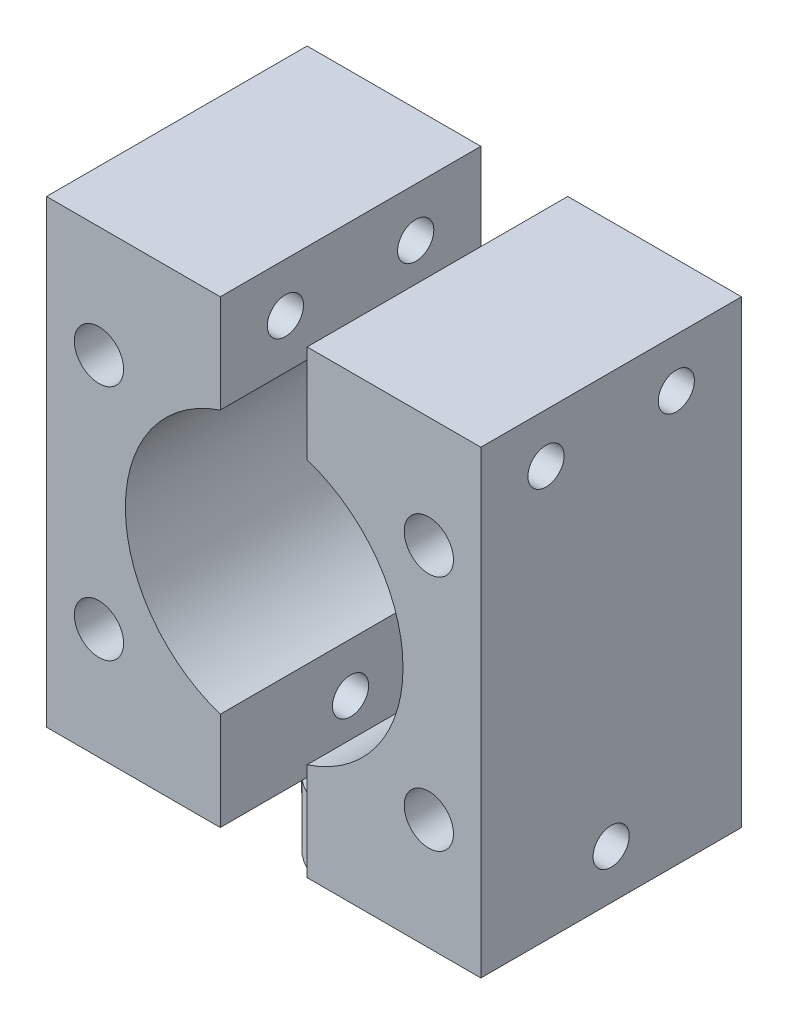
ISO-10303-21;
HEADER;
FILE_DESCRIPTION(('STEP AP214'),'2;1');
FILE_NAME('part.step','',(''),(''),'','','');
FILE_SCHEMA(('AUTOMOTIVE_DESIGN { 1 0 10303 214 1 1 1 1 }'));
ENDSEC;
DATA;
#1=APPLICATION_CONTEXT('core data for automotive mechanical design processes');
#2=APPLICATION_PROTOCOL_DEFINITION('international standard','automotive_design',2000,#1);
#3=PRODUCT_CONTEXT('',#1,'mechanical');
#4=PRODUCT('Part','Part','',(#3));
#5=PRODUCT_RELATED_PRODUCT_CATEGORY('part','',(#4));
#6=PRODUCT_DEFINITION_FORMATION('','',#4);
#7=PRODUCT_DEFINITION_CONTEXT('part definition',#1,'design');
#8=PRODUCT_DEFINITION('design','',#6,#7);
#9=PRODUCT_DEFINITION_SHAPE('','',#8);
#10=(LENGTH_UNIT() NAMED_UNIT(*) SI_UNIT(.MILLI.,.METRE.));
#11=(NAMED_UNIT(*) PLANE_ANGLE_UNIT() SI_UNIT($,.RADIAN.));
#12=(NAMED_UNIT(*) SI_UNIT($,.STERADIAN.) SOLID_ANGLE_UNIT());
#13=UNCERTAINTY_MEASURE_WITH_UNIT(LENGTH_MEASURE(1.E-05),#10,'distance_accuracy_value','');
#14=(GEOMETRIC_REPRESENTATION_CONTEXT(3) GLOBAL_UNCERTAINTY_ASSIGNED_CONTEXT((#13)) GLOBAL_UNIT_ASSIGNED_CONTEXT((#10,
#11,#12)) REPRESENTATION_CONTEXT('',''));
#15=CARTESIAN_POINT('',(0.,0.,0.));
#16=DIRECTION('',(0.,0.,1.));
#17=DIRECTION('',(1.,0.,0.));
#18=AXIS2_PLACEMENT_3D('',#15,#16,#17);
#19=CARTESIAN_POINT('',(-15.,4.5,-8.65612108217187));
#20=DIRECTION('',(0.,-1.,0.));
#21=DIRECTION('',(0.,0.,-1.));
#22=AXIS2_PLACEMENT_3D('',#19,#20,#21);
#23=PLANE('',#22);
#24=CARTESIAN_POINT('',(-6.4951905283833,4.5,3.74999999999998));
#25=DIRECTION('',(0.,-1.,0.));
#26=DIRECTION('',(0.,0.,-1.));
#27=AXIS2_PLACEMENT_3D('',#24,#25,#26);
#28=CIRCLE('',#27,0.79999999999999);
#29=CARTESIAN_POINT('',(-6.4951905283833,4.5,2.94999999999999));
#30=VERTEX_POINT('',#29);
#31=EDGE_CURVE('E128',#30,#30,#28,.T.);
#32=ORIENTED_EDGE('',*,*,#31,.F.);
#33=EDGE_LOOP('',(#32));
#34=FACE_BOUND('',#33,.T.);
#35=DIRECTION('',(0.,0.,-1.));
#36=VECTOR('',#35,1.);
#37=CARTESIAN_POINT('',(-3.,4.5,-8.65612108217187));
#38=LINE('',#37,#36);
#39=CARTESIAN_POINT('',(-3.,4.5,-3.68272996566406));
#40=VERTEX_POINT('',#39);
#41=CARTESIAN_POINT('',(-3.,4.5,-8.65612108217187));
#42=VERTEX_POINT('',#41);
#43=EDGE_CURVE('E194',#40,#42,#38,.T.);
#44=ORIENTED_EDGE('',*,*,#43,.F.);
#45=CARTESIAN_POINT('',(0.,4.5,0.));
#46=DIRECTION('',(0.,1.,0.));
#47=DIRECTION('',(0.,0.,1.));
#48=AXIS2_PLACEMENT_3D('',#45,#46,#47);
#49=CIRCLE('',#48,4.75);
#50=CARTESIAN_POINT('',(-3.,4.5,3.68272996566406));
#51=VERTEX_POINT('',#50);
#52=EDGE_CURVE('E167',#40,#51,#49,.T.);
#53=ORIENTED_EDGE('',*,*,#52,.T.);
#54=CARTESIAN_POINT('',(-3.,4.5,9.34387891782813));
#55=VERTEX_POINT('',#54);
#56=EDGE_CURVE('E180',#55,#51,#38,.T.);
#57=ORIENTED_EDGE('',*,*,#56,.F.);
#58=DIRECTION('',(1.,0.,0.));
#59=VECTOR('',#58,1.);
#60=CARTESIAN_POINT('',(-3.,4.5,9.34387891782813));
#61=LINE('',#60,#59);
#62=CARTESIAN_POINT('',(-15.,4.5,9.34387891782813));
#63=VERTEX_POINT('',#62);
#64=EDGE_CURVE('E191',#63,#55,#61,.T.);
#65=ORIENTED_EDGE('',*,*,#64,.F.);
#66=DIRECTION('',(0.,0.,1.));
#67=VECTOR('',#66,1.);
#68=CARTESIAN_POINT('',(-15.,4.5,9.34387891782813));
#69=LINE('',#68,#67);
#70=CARTESIAN_POINT('',(-15.,4.5,-8.65612108217187));
#71=VERTEX_POINT('',#70);
#72=EDGE_CURVE('E189',#71,#63,#69,.T.);
#73=ORIENTED_EDGE('',*,*,#72,.F.);
#74=DIRECTION('',(-1.,0.,0.));
#75=VECTOR('',#74,1.);
#76=CARTESIAN_POINT('',(-3.,4.5,-8.65612108217187));
#77=LINE('',#76,#75);
#78=EDGE_CURVE('E175',#42,#71,#77,.T.);
#79=ORIENTED_EDGE('',*,*,#78,.F.);
#80=EDGE_LOOP('',(#44,#53,#57,#65,#73,#79));
#81=FACE_BOUND('',#80,.T.);
#82=ADVANCED_FACE('F43',(#34,#81),#23,.T.);
#83=CARTESIAN_POINT('',(-3.,36.25,-8.65612108217187));
#84=DIRECTION('',(0.,0.,1.));
#85=DIRECTION('',(1.,0.,0.));
#86=AXIS2_PLACEMENT_3D('',#83,#84,#85);
#87=PLANE('',#86);
#88=CARTESIAN_POINT('',(-11.3772186390947,28.569859147129,-8.65612108217187));
#89=DIRECTION('',(0.,0.,1.));
#90=DIRECTION('',(1.,0.,0.));
#91=AXIS2_PLACEMENT_3D('',#88,#89,#90);
#92=CIRCLE('',#91,1.7);
#93=CARTESIAN_POINT('',(-9.67721863909473,28.569859147129,-8.65612108217187));
#94=VERTEX_POINT('',#93);
#95=EDGE_CURVE('E146',#94,#94,#92,.T.);
#96=ORIENTED_EDGE('',*,*,#95,.T.);
#97=EDGE_LOOP('',(#96));
#98=FACE_BOUND('',#97,.T.);
#99=CARTESIAN_POINT('',(-11.3772186390947,12.180140852871,-8.65612108217187));
#100=DIRECTION('',(0.,0.,1.));
#101=DIRECTION('',(1.,0.,0.));
#102=AXIS2_PLACEMENT_3D('',#99,#100,#101);
#103=CIRCLE('',#102,1.7);
#104=CARTESIAN_POINT('',(-9.67721863909473,12.180140852871,-8.65612108217187));
#105=VERTEX_POINT('',#104);
#106=EDGE_CURVE('E152',#105,#105,#103,.T.);
#107=ORIENTED_EDGE('',*,*,#106,.T.);
#108=EDGE_LOOP('',(#107));
#109=FACE_BOUND('',#108,.T.);
#110=ORIENTED_EDGE('',*,*,#78,.T.);
#111=DIRECTION('',(0.,-1.,0.));
#112=VECTOR('',#111,1.);
#113=CARTESIAN_POINT('',(-15.,36.25,-8.65612108217187));
#114=LINE('',#113,#112);
#115=CARTESIAN_POINT('',(-15.,36.25,-8.65612108217187));
#116=VERTEX_POINT('',#115);
#117=EDGE_CURVE('E207',#116,#71,#114,.T.);
#118=ORIENTED_EDGE('',*,*,#117,.F.);
#119=DIRECTION('',(-1.,0.,0.));
#120=VECTOR('',#119,1.);
#121=CARTESIAN_POINT('',(-3.,36.25,-8.65612108217187));
#122=LINE('',#121,#120);
#123=CARTESIAN_POINT('',(-3.,36.25,-8.65612108217187));
#124=VERTEX_POINT('',#123);
#125=EDGE_CURVE('E176',#124,#116,#122,.T.);
#126=ORIENTED_EDGE('',*,*,#125,.F.);
#127=DIRECTION('',(0.,-1.,0.));
#128=VECTOR('',#127,1.);
#129=CARTESIAN_POINT('',(-3.,36.25,-8.65612108217187));
#130=LINE('',#129,#128);
#131=EDGE_CURVE('E186',#124,#42,#130,.T.);
#132=ORIENTED_EDGE('',*,*,#131,.T.);
#133=EDGE_LOOP('',(#110,#118,#126,#132));
#134=FACE_BOUND('',#133,.T.);
#135=ADVANCED_FACE('F45',(#98,#109,#134),#87,.F.);
#136=CARTESIAN_POINT('',(-15.,36.25,9.34387891782813));
#137=DIRECTION('',(1.,0.,0.));
#138=DIRECTION('',(0.,0.,-1.));
#139=AXIS2_PLACEMENT_3D('',#136,#137,#138);
#140=PLANE('',#139);
#141=CARTESIAN_POINT('',(-15.,32.8715786406462,4.84387891782813));
#142=DIRECTION('',(1.,0.,0.));
#143=DIRECTION('',(0.,0.,-1.));
#144=AXIS2_PLACEMENT_3D('',#141,#142,#143);
#145=CIRCLE('',#144,1.24999999999998);
#146=CARTESIAN_POINT('',(-15.,32.8715786406462,3.59387891782815));
#147=VERTEX_POINT('',#146);
#148=EDGE_CURVE('E127',#147,#147,#145,.T.);
#149=ORIENTED_EDGE('',*,*,#148,.T.);
#150=EDGE_LOOP('',(#149));
#151=FACE_BOUND('',#150,.T.);
#152=CARTESIAN_POINT('',(-15.,32.8715786406462,-4.15612108217187));
#153=DIRECTION('',(1.,0.,0.));
#154=DIRECTION('',(0.,0.,-1.));
#155=AXIS2_PLACEMENT_3D('',#152,#153,#154);
#156=CIRCLE('',#155,1.24999999999998);
#157=CARTESIAN_POINT('',(-15.,32.8715786406462,-5.40612108217185));
#158=VERTEX_POINT('',#157);
#159=EDGE_CURVE('E135',#158,#158,#156,.T.);
#160=ORIENTED_EDGE('',*,*,#159,.T.);
#161=EDGE_LOOP('',(#160));
#162=FACE_BOUND('',#161,.T.);
#163=CARTESIAN_POINT('',(-15.,7.87842135935374,0.34387891782813));
#164=DIRECTION('',(1.,0.,0.));
#165=DIRECTION('',(0.,0.,-1.));
#166=AXIS2_PLACEMENT_3D('',#163,#164,#165);
#167=CIRCLE('',#166,1.24999999999998);
#168=CARTESIAN_POINT('',(-15.,7.87842135935374,-0.906121082171854));
#169=VERTEX_POINT('',#168);
#170=EDGE_CURVE('E139',#169,#169,#167,.T.);
#171=ORIENTED_EDGE('',*,*,#170,.T.);
#172=EDGE_LOOP('',(#171));
#173=FACE_BOUND('',#172,.T.);
#174=ORIENTED_EDGE('',*,*,#72,.T.);
#175=DIRECTION('',(0.,-1.,0.));
#176=VECTOR('',#175,1.);
#177=CARTESIAN_POINT('',(-15.,36.25,9.34387891782813));
#178=LINE('',#177,#176);
#179=CARTESIAN_POINT('',(-15.,36.25,9.34387891782813));
#180=VERTEX_POINT('',#179);
#181=EDGE_CURVE('E204',#180,#63,#178,.T.);
#182=ORIENTED_EDGE('',*,*,#181,.F.);
#183=DIRECTION('',(0.,0.,1.));
#184=VECTOR('',#183,1.);
#185=CARTESIAN_POINT('',(-15.,36.25,9.34387891782813));
#186=LINE('',#185,#184);
#187=EDGE_CURVE('E179',#116,#180,#186,.T.);
#188=ORIENTED_EDGE('',*,*,#187,.F.);
#189=ORIENTED_EDGE('',*,*,#117,.T.);
#190=EDGE_LOOP('',(#174,#182,#188,#189));
#191=FACE_BOUND('',#190,.T.);
#192=ADVANCED_FACE('F242',(#151,#162,#173,#191),#140,.F.);
#193=CARTESIAN_POINT('',(-3.,36.25,9.34387891782813));
#194=DIRECTION('',(0.,0.,-1.));
#195=DIRECTION('',(-1.,0.,0.));
#196=AXIS2_PLACEMENT_3D('',#193,#194,#195);
#197=PLANE('',#196);
#198=CARTESIAN_POINT('',(-11.3772186390947,28.569859147129,9.34387891782813));
#199=DIRECTION('',(0.,0.,1.));
#200=DIRECTION('',(1.,0.,0.));
#201=AXIS2_PLACEMENT_3D('',#198,#199,#200);
#202=CIRCLE('',#201,1.69999999999999);
#203=CARTESIAN_POINT('',(-9.67721863909474,28.569859147129,9.34387891782813));
#204=VERTEX_POINT('',#203);
#205=EDGE_CURVE('E143',#204,#204,#202,.T.);
#206=ORIENTED_EDGE('',*,*,#205,.F.);
#207=EDGE_LOOP('',(#206));
#208=FACE_BOUND('',#207,.T.);
#209=CARTESIAN_POINT('',(-11.3772186390947,12.180140852871,9.34387891782813));
#210=DIRECTION('',(0.,0.,1.));
#211=DIRECTION('',(1.,0.,0.));
#212=AXIS2_PLACEMENT_3D('',#209,#210,#211);
#213=CIRCLE('',#212,1.69999999999999);
#214=CARTESIAN_POINT('',(-9.67721863909474,12.180140852871,9.34387891782813));
#215=VERTEX_POINT('',#214);
#216=EDGE_CURVE('E149',#215,#215,#213,.T.);
#217=ORIENTED_EDGE('',*,*,#216,.F.);
#218=EDGE_LOOP('',(#217));
#219=FACE_BOUND('',#218,.T.);
#220=DIRECTION('',(0.,-1.,0.));
#221=VECTOR('',#220,1.);
#222=CARTESIAN_POINT('',(-3.,36.25,9.34387891782813));
#223=LINE('',#222,#221);
#224=CARTESIAN_POINT('',(-3.,11.2790892751317,9.34387891782813));
#225=VERTEX_POINT('',#224);
#226=EDGE_CURVE('E200',#225,#55,#223,.T.);
#227=ORIENTED_EDGE('',*,*,#226,.F.);
#228=CARTESIAN_POINT('',(0.0337666909677441,20.375,9.34387891782813));
#229=DIRECTION('',(0.,0.,1.));
#230=DIRECTION('',(1.,0.,0.));
#231=AXIS2_PLACEMENT_3D('',#228,#229,#230);
#232=CIRCLE('',#231,9.5885);
#233=CARTESIAN_POINT('',(-3.,29.4709107248683,9.34387891782813));
#234=VERTEX_POINT('',#233);
#235=EDGE_CURVE('E155',#234,#225,#232,.T.);
#236=ORIENTED_EDGE('',*,*,#235,.F.);
#237=CARTESIAN_POINT('',(-3.,36.25,9.34387891782813));
#238=VERTEX_POINT('',#237);
#239=EDGE_CURVE('E201',#238,#234,#223,.T.);
#240=ORIENTED_EDGE('',*,*,#239,.F.);
#241=DIRECTION('',(1.,0.,0.));
#242=VECTOR('',#241,1.);
#243=CARTESIAN_POINT('',(-3.,36.25,9.34387891782813));
#244=LINE('',#243,#242);
#245=EDGE_CURVE('E182',#180,#238,#244,.T.);
#246=ORIENTED_EDGE('',*,*,#245,.F.);
#247=ORIENTED_EDGE('',*,*,#181,.T.);
#248=ORIENTED_EDGE('',*,*,#64,.T.);
#249=EDGE_LOOP('',(#227,#236,#240,#246,#247,#248));
#250=FACE_BOUND('',#249,.T.);
#251=ADVANCED_FACE('F252',(#208,#219,#250),#197,.F.);
#252=CARTESIAN_POINT('',(-3.,36.25,-8.65612108217187));
#253=DIRECTION('',(-1.,0.,0.));
#254=DIRECTION('',(0.,0.,1.));
#255=AXIS2_PLACEMENT_3D('',#252,#253,#254);
#256=PLANE('',#255);
#257=CARTESIAN_POINT('',(-3.,32.8715786406462,4.84387891782813));
#258=DIRECTION('',(-1.,0.,0.));
#259=DIRECTION('',(0.,0.,1.));
#260=AXIS2_PLACEMENT_3D('',#257,#258,#259);
#261=CIRCLE('',#260,1.24999999999998);
#262=CARTESIAN_POINT('',(-3.,32.8715786406462,6.09387891782811));
#263=VERTEX_POINT('',#262);
#264=EDGE_CURVE('E47',#263,#263,#261,.T.);
#265=ORIENTED_EDGE('',*,*,#264,.T.);
#266=EDGE_LOOP('',(#265));
#267=FACE_BOUND('',#266,.T.);
#268=CARTESIAN_POINT('',(-3.,32.8715786406462,-4.15612108217187));
#269=DIRECTION('',(-1.,0.,0.));
#270=DIRECTION('',(0.,0.,1.));
#271=AXIS2_PLACEMENT_3D('',#268,#269,#270);
#272=CIRCLE('',#271,1.24999999999998);
#273=CARTESIAN_POINT('',(-3.,32.8715786406462,-2.90612108217189));
#274=VERTEX_POINT('',#273);
#275=EDGE_CURVE('E138',#274,#274,#272,.T.);
#276=ORIENTED_EDGE('',*,*,#275,.T.);
#277=EDGE_LOOP('',(#276));
#278=FACE_BOUND('',#277,.T.);
#279=CARTESIAN_POINT('',(-3.,7.87842135935374,0.34387891782813));
#280=DIRECTION('',(-1.,0.,0.));
#281=DIRECTION('',(0.,0.,1.));
#282=AXIS2_PLACEMENT_3D('',#279,#280,#281);
#283=CIRCLE('',#282,1.24999999999999);
#284=CARTESIAN_POINT('',(-3.,7.87842135935374,1.59387891782812));
#285=VERTEX_POINT('',#284);
#286=EDGE_CURVE('E142',#285,#285,#283,.T.);
#287=ORIENTED_EDGE('',*,*,#286,.T.);
#288=EDGE_LOOP('',(#287));
#289=FACE_BOUND('',#288,.T.);
#290=DIRECTION('',(0.,1.,0.));
#291=VECTOR('',#290,1.);
#292=CARTESIAN_POINT('',(-3.,36.25,-7.65612108217187));
#293=LINE('',#292,#291);
#294=CARTESIAN_POINT('',(-3.,11.2790892751317,-7.65612108217187));
#295=VERTEX_POINT('',#294);
#296=CARTESIAN_POINT('',(-3.,29.4709107248683,-7.65612108217187));
#297=VERTEX_POINT('',#296);
#298=EDGE_CURVE('E210',#295,#297,#293,.T.);
#299=ORIENTED_EDGE('',*,*,#298,.F.);
#300=DIRECTION('',(0.,0.,1.));
#301=VECTOR('',#300,1.);
#302=CARTESIAN_POINT('',(-3.,11.2790892751317,-7.65612108217187));
#303=LINE('',#302,#301);
#304=EDGE_CURVE('E12',#295,#225,#303,.T.);
#305=ORIENTED_EDGE('',*,*,#304,.T.);
#306=ORIENTED_EDGE('',*,*,#226,.T.);
#307=ORIENTED_EDGE('',*,*,#56,.T.);
#308=EDGE_CURVE('E197',#51,#40,#38,.T.);
#309=ORIENTED_EDGE('',*,*,#308,.T.);
#310=ORIENTED_EDGE('',*,*,#43,.T.);
#311=ORIENTED_EDGE('',*,*,#131,.F.);
#312=DIRECTION('',(0.,0.,-1.));
#313=VECTOR('',#312,1.);
#314=CARTESIAN_POINT('',(-3.,36.25,-8.65612108217187));
#315=LINE('',#314,#313);
#316=EDGE_CURVE('E184',#238,#124,#315,.T.);
#317=ORIENTED_EDGE('',*,*,#316,.F.);
#318=ORIENTED_EDGE('',*,*,#239,.T.);
#319=DIRECTION('',(0.,0.,1.));
#320=VECTOR('',#319,1.);
#321=CARTESIAN_POINT('',(-3.,29.4709107248683,-7.65612108217187));
#322=LINE('',#321,#320);
#323=EDGE_CURVE('E52',#234,#297,#322,.F.);
#324=ORIENTED_EDGE('',*,*,#323,.T.);
#325=EDGE_LOOP('',(#299,#305,#306,#307,#309,#310,#311,#317,#318,#324));
#326=FACE_BOUND('',#325,.T.);
#327=ADVANCED_FACE('F218',(#267,#278,#289,#326),#256,.F.);
#328=CARTESIAN_POINT('',(-15.,36.25,-8.65612108217187));
#329=DIRECTION('',(0.,-1.,0.));
#330=DIRECTION('',(0.,0.,-1.));
#331=AXIS2_PLACEMENT_3D('',#328,#329,#330);
#332=PLANE('',#331);
#333=ORIENTED_EDGE('',*,*,#125,.T.);
#334=ORIENTED_EDGE('',*,*,#187,.T.);
#335=ORIENTED_EDGE('',*,*,#245,.T.);
#336=ORIENTED_EDGE('',*,*,#316,.T.);
#337=EDGE_LOOP('',(#333,#334,#335,#336));
#338=FACE_BOUND('',#337,.T.);
#339=ADVANCED_FACE('F248',(#338),#332,.F.);
#340=CARTESIAN_POINT('',(-10.5914213562373,4.5,0.));
#341=DIRECTION('',(0.,1.,0.));
#342=DIRECTION('',(0.,0.,1.));
#343=AXIS2_PLACEMENT_3D('',#340,#341,#342);
#344=PLANE('',#343);
#345=ORIENTED_EDGE('',*,*,#308,.F.);
#346=CARTESIAN_POINT('',(-1.5,4.5,4.50693909432999));
#347=VERTEX_POINT('',#346);
#348=EDGE_CURVE('E67',#51,#347,#49,.T.);
#349=ORIENTED_EDGE('',*,*,#348,.T.);
#350=DIRECTION('',(0.,0.,1.));
#351=VECTOR('',#350,1.);
#352=CARTESIAN_POINT('',(-1.5,4.5,0.));
#353=LINE('',#352,#351);
#354=CARTESIAN_POINT('',(-1.5,4.5,-4.50693909432999));
#355=VERTEX_POINT('',#354);
#356=EDGE_CURVE('E159',#355,#347,#353,.T.);
#357=ORIENTED_EDGE('',*,*,#356,.F.);
#358=EDGE_CURVE('E163',#355,#40,#49,.T.);
#359=ORIENTED_EDGE('',*,*,#358,.T.);
#360=EDGE_LOOP('',(#345,#349,#357,#359));
#361=FACE_BOUND('',#360,.T.);
#362=ADVANCED_FACE('F287',(#361),#344,.T.);
#363=CARTESIAN_POINT('',(-1.5,4.5,0.));
#364=DIRECTION('',(1.,0.,0.));
#365=DIRECTION('',(0.,0.,-1.));
#366=AXIS2_PLACEMENT_3D('',#363,#364,#365);
#367=PLANE('',#366);
#368=DIRECTION('',(0.,0.,1.));
#369=VECTOR('',#368,1.);
#370=CARTESIAN_POINT('',(-1.5,0.,0.));
#371=LINE('',#370,#369);
#372=CARTESIAN_POINT('',(-1.5,0.,-4.50693909432999));
#373=VERTEX_POINT('',#372);
#374=CARTESIAN_POINT('',(-1.5,0.,4.50693909432999));
#375=VERTEX_POINT('',#374);
#376=EDGE_CURVE('E157',#373,#375,#371,.T.);
#377=ORIENTED_EDGE('',*,*,#376,.F.);
#378=DIRECTION('',(0.,-1.,0.));
#379=VECTOR('',#378,1.);
#380=CARTESIAN_POINT('',(-1.5,4.5,-4.50693909432999));
#381=LINE('',#380,#379);
#382=EDGE_CURVE('E173',#355,#373,#381,.T.);
#383=ORIENTED_EDGE('',*,*,#382,.F.);
#384=ORIENTED_EDGE('',*,*,#356,.T.);
#385=DIRECTION('',(0.,-1.,0.));
#386=VECTOR('',#385,1.);
#387=CARTESIAN_POINT('',(-1.5,4.5,4.50693909432999));
#388=LINE('',#387,#386);
#389=EDGE_CURVE('E166',#347,#375,#388,.T.);
#390=ORIENTED_EDGE('',*,*,#389,.T.);
#391=EDGE_LOOP('',(#377,#383,#384,#390));
#392=FACE_BOUND('',#391,.T.);
#393=ADVANCED_FACE('F291',(#392),#367,.T.);
#394=CARTESIAN_POINT('',(0.,4.5,0.));
#395=DIRECTION('',(0.,-1.,0.));
#396=DIRECTION('',(0.,0.,-1.));
#397=AXIS2_PLACEMENT_3D('',#394,#395,#396);
#398=CYLINDRICAL_SURFACE('',#397,4.75);
#399=CARTESIAN_POINT('',(0.,0.,0.));
#400=DIRECTION('',(0.,1.,0.));
#401=DIRECTION('',(0.,0.,1.));
#402=AXIS2_PLACEMENT_3D('',#399,#400,#401);
#403=CIRCLE('',#402,4.75);
#404=EDGE_CURVE('E162',#373,#375,#403,.T.);
#405=ORIENTED_EDGE('',*,*,#404,.T.);
#406=ORIENTED_EDGE('',*,*,#389,.F.);
#407=ORIENTED_EDGE('',*,*,#348,.F.);
#408=ORIENTED_EDGE('',*,*,#52,.F.);
#409=ORIENTED_EDGE('',*,*,#358,.F.);
#410=ORIENTED_EDGE('',*,*,#382,.T.);
#411=EDGE_LOOP('',(#405,#406,#407,#408,#409,#410));
#412=FACE_BOUND('',#411,.T.);
#413=ADVANCED_FACE('F297',(#412),#398,.T.);
#414=CARTESIAN_POINT('',(-10.5914213562373,0.,0.));
#415=DIRECTION('',(0.,1.,0.));
#416=DIRECTION('',(0.,0.,1.));
#417=AXIS2_PLACEMENT_3D('',#414,#415,#416);
#418=PLANE('',#417);
#419=ORIENTED_EDGE('',*,*,#376,.T.);
#420=ORIENTED_EDGE('',*,*,#404,.F.);
#421=EDGE_LOOP('',(#419,#420));
#422=FACE_BOUND('',#421,.T.);
#423=ADVANCED_FACE('F303',(#422),#418,.F.);
#424=CARTESIAN_POINT('',(0.0337666909677441,20.375,-7.65612108217187));
#425=DIRECTION('',(0.,0.,1.));
#426=DIRECTION('',(1.,0.,0.));
#427=AXIS2_PLACEMENT_3D('',#424,#425,#426);
#428=CYLINDRICAL_SURFACE('',#427,9.5885);
#429=CARTESIAN_POINT('',(0.0337666909677441,20.375,-7.65612108217187));
#430=DIRECTION('',(0.,0.,1.));
#431=DIRECTION('',(1.,0.,0.));
#432=AXIS2_PLACEMENT_3D('',#429,#430,#431);
#433=CIRCLE('',#432,9.5885);
#434=EDGE_CURVE('E59',#297,#295,#433,.T.);
#435=ORIENTED_EDGE('',*,*,#434,.F.);
#436=ORIENTED_EDGE('',*,*,#323,.F.);
#437=ORIENTED_EDGE('',*,*,#235,.T.);
#438=ORIENTED_EDGE('',*,*,#304,.F.);
#439=EDGE_LOOP('',(#435,#436,#437,#438));
#440=FACE_BOUND('',#439,.T.);
#441=ADVANCED_FACE('F301',(#440),#428,.F.);
#442=CARTESIAN_POINT('',(0.0337666909677441,20.375,-7.65612108217187));
#443=DIRECTION('',(0.,0.,1.));
#444=DIRECTION('',(1.,0.,0.));
#445=AXIS2_PLACEMENT_3D('',#442,#443,#444);
#446=PLANE('',#445);
#447=ORIENTED_EDGE('',*,*,#298,.T.);
#448=ORIENTED_EDGE('',*,*,#434,.T.);
#449=EDGE_LOOP('',(#447,#448));
#450=FACE_BOUND('',#449,.T.);
#451=ADVANCED_FACE('F326',(#450),#446,.T.);
#452=CARTESIAN_POINT('',(-11.3772186390947,12.180140852871,9.34387891782813));
#453=DIRECTION('',(0.,0.,1.));
#454=DIRECTION('',(1.,0.,0.));
#455=AXIS2_PLACEMENT_3D('',#452,#453,#454);
#456=CYLINDRICAL_SURFACE('',#455,1.69999999999999);
#457=ORIENTED_EDGE('',*,*,#106,.F.);
#458=EDGE_LOOP('',(#457));
#459=FACE_BOUND('',#458,.T.);
#460=ORIENTED_EDGE('',*,*,#216,.T.);
#461=EDGE_LOOP('',(#460));
#462=FACE_BOUND('',#461,.T.);
#463=ADVANCED_FACE('F332',(#459,#462),#456,.F.);
#464=CARTESIAN_POINT('',(-11.3772186390947,28.569859147129,9.34387891782813));
#465=DIRECTION('',(0.,0.,1.));
#466=DIRECTION('',(1.,0.,0.));
#467=AXIS2_PLACEMENT_3D('',#464,#465,#466);
#468=CYLINDRICAL_SURFACE('',#467,1.69999999999999);
#469=ORIENTED_EDGE('',*,*,#95,.F.);
#470=EDGE_LOOP('',(#469));
#471=FACE_BOUND('',#470,.T.);
#472=ORIENTED_EDGE('',*,*,#205,.T.);
#473=EDGE_LOOP('',(#472));
#474=FACE_BOUND('',#473,.T.);
#475=ADVANCED_FACE('F232',(#471,#474),#468,.F.);
#476=CARTESIAN_POINT('',(15.,7.87842135935374,0.34387891782813));
#477=DIRECTION('',(1.,0.,0.));
#478=DIRECTION('',(0.,0.,-1.));
#479=AXIS2_PLACEMENT_3D('',#476,#477,#478);
#480=CYLINDRICAL_SURFACE('',#479,1.24999999999999);
#481=ORIENTED_EDGE('',*,*,#170,.F.);
#482=EDGE_LOOP('',(#481));
#483=FACE_BOUND('',#482,.T.);
#484=ORIENTED_EDGE('',*,*,#286,.F.);
#485=EDGE_LOOP('',(#484));
#486=FACE_BOUND('',#485,.T.);
#487=ADVANCED_FACE('F223',(#483,#486),#480,.F.);
#488=CARTESIAN_POINT('',(15.,32.8715786406462,-4.15612108217187));
#489=DIRECTION('',(1.,0.,0.));
#490=DIRECTION('',(0.,0.,-1.));
#491=AXIS2_PLACEMENT_3D('',#488,#489,#490);
#492=CYLINDRICAL_SURFACE('',#491,1.24999999999998);
#493=ORIENTED_EDGE('',*,*,#159,.F.);
#494=EDGE_LOOP('',(#493));
#495=FACE_BOUND('',#494,.T.);
#496=ORIENTED_EDGE('',*,*,#275,.F.);
#497=EDGE_LOOP('',(#496));
#498=FACE_BOUND('',#497,.T.);
#499=ADVANCED_FACE('F221',(#495,#498),#492,.F.);
#500=CARTESIAN_POINT('',(15.,32.8715786406462,4.84387891782813));
#501=DIRECTION('',(1.,0.,0.));
#502=DIRECTION('',(0.,0.,-1.));
#503=AXIS2_PLACEMENT_3D('',#500,#501,#502);
#504=CYLINDRICAL_SURFACE('',#503,1.24999999999998);
#505=ORIENTED_EDGE('',*,*,#148,.F.);
#506=EDGE_LOOP('',(#505));
#507=FACE_BOUND('',#506,.T.);
#508=ORIENTED_EDGE('',*,*,#264,.F.);
#509=EDGE_LOOP('',(#508));
#510=FACE_BOUND('',#509,.T.);
#511=ADVANCED_FACE('F121',(#507,#510),#504,.F.);
#512=CARTESIAN_POINT('',(-6.4951905283833,10.5,3.74999999999998));
#513=DIRECTION('',(0.,-1.,0.));
#514=DIRECTION('',(0.,0.,-1.));
#515=AXIS2_PLACEMENT_3D('',#512,#513,#514);
#516=CONICAL_SURFACE('',#515,0.799999999999995,1.02974425867665);
#517=CARTESIAN_POINT('',(-6.4951905283833,10.980688495222,3.74999999999998));
#518=VERTEX_POINT('',#517);
#519=VERTEX_LOOP('',#518);
#520=FACE_BOUND('',#519,.T.);
#521=CARTESIAN_POINT('',(-6.4951905283833,10.5,3.74999999999998));
#522=DIRECTION('',(0.,-1.,0.));
#523=DIRECTION('',(0.,0.,-1.));
#524=AXIS2_PLACEMENT_3D('',#521,#522,#523);
#525=CIRCLE('',#524,0.799999999999995);
#526=CARTESIAN_POINT('',(-6.4951905283833,10.5,2.94999999999999));
#527=VERTEX_POINT('',#526);
#528=EDGE_CURVE('E125',#527,#527,#525,.T.);
#529=ORIENTED_EDGE('',*,*,#528,.T.);
#530=EDGE_LOOP('',(#529));
#531=FACE_BOUND('',#530,.T.);
#532=ADVANCED_FACE('F117',(#520,#531),#516,.F.);
#533=CARTESIAN_POINT('',(-6.4951905283833,4.5,3.74999999999998));
#534=DIRECTION('',(0.,-1.,0.));
#535=DIRECTION('',(0.,0.,-1.));
#536=AXIS2_PLACEMENT_3D('',#533,#534,#535);
#537=CYLINDRICAL_SURFACE('',#536,0.799999999999993);
#538=ORIENTED_EDGE('',*,*,#528,.F.);
#539=EDGE_LOOP('',(#538));
#540=FACE_BOUND('',#539,.T.);
#541=ORIENTED_EDGE('',*,*,#31,.T.);
#542=EDGE_LOOP('',(#541));
#543=FACE_BOUND('',#542,.T.);
#544=ADVANCED_FACE('F120',(#540,#543),#537,.F.);
#545=CLOSED_SHELL('',(#82,#135,#192,#251,#327,#339,#362,#393,#413,#423,#441,#451,#463,#475,#487,
#499,#511,#532,#544));
#546=MANIFOLD_SOLID_BREP('B2',#545);
#547=CARTESIAN_POINT('',(3.,36.25,-8.65612108217187));
#548=DIRECTION('',(0.,0.,1.));
#549=DIRECTION('',(1.,0.,0.));
#550=AXIS2_PLACEMENT_3D('',#547,#548,#549);
#551=PLANE('',#550);
#552=CARTESIAN_POINT('',(11.4050067096299,12.171834609744,-8.65612108217187));
#553=DIRECTION('',(0.,0.,1.));
#554=DIRECTION('',(1.,0.,0.));
#555=AXIS2_PLACEMENT_3D('',#552,#553,#554);
#556=CIRCLE('',#555,1.7);
#557=CARTESIAN_POINT('',(13.1050067096299,12.171834609744,-8.65612108217187));
#558=VERTEX_POINT('',#557);
#559=EDGE_CURVE('E552',#558,#558,#556,.T.);
#560=ORIENTED_EDGE('',*,*,#559,.T.);
#561=EDGE_LOOP('',(#560));
#562=FACE_BOUND('',#561,.T.);
#563=CARTESIAN_POINT('',(11.4050067096299,28.578165390256,-8.65612108217187));
#564=DIRECTION('',(0.,0.,1.));
#565=DIRECTION('',(1.,0.,0.));
#566=AXIS2_PLACEMENT_3D('',#563,#564,#565);
#567=CIRCLE('',#566,1.7);
#568=CARTESIAN_POINT('',(13.1050067096299,28.578165390256,-8.65612108217187));
#569=VERTEX_POINT('',#568);
#570=EDGE_CURVE('E558',#569,#569,#567,.T.);
#571=ORIENTED_EDGE('',*,*,#570,.T.);
#572=EDGE_LOOP('',(#571));
#573=FACE_BOUND('',#572,.T.);
#574=DIRECTION('',(-1.,0.,0.));
#575=VECTOR('',#574,1.);
#576=CARTESIAN_POINT('',(3.,4.5,-8.65612108217187));
#577=LINE('',#576,#575);
#578=CARTESIAN_POINT('',(15.,4.5,-8.65612108217187));
#579=VERTEX_POINT('',#578);
#580=CARTESIAN_POINT('',(3.,4.5,-8.65612108217187));
#581=VERTEX_POINT('',#580);
#582=EDGE_CURVE('E586',#579,#581,#577,.T.);
#583=ORIENTED_EDGE('',*,*,#582,.T.);
#584=DIRECTION('',(0.,-1.,0.));
#585=VECTOR('',#584,1.);
#586=CARTESIAN_POINT('',(3.,36.25,-8.65612108217187));
#587=LINE('',#586,#585);
#588=CARTESIAN_POINT('',(3.,36.25,-8.65612108217187));
#589=VERTEX_POINT('',#588);
#590=EDGE_CURVE('E617',#589,#581,#587,.T.);
#591=ORIENTED_EDGE('',*,*,#590,.F.);
#592=DIRECTION('',(-1.,0.,0.));
#593=VECTOR('',#592,1.);
#594=CARTESIAN_POINT('',(3.,36.25,-8.65612108217187));
#595=LINE('',#594,#593);
#596=CARTESIAN_POINT('',(15.,36.25,-8.65612108217187));
#597=VERTEX_POINT('',#596);
#598=EDGE_CURVE('E587',#597,#589,#595,.T.);
#599=ORIENTED_EDGE('',*,*,#598,.F.);
#600=DIRECTION('',(0.,-1.,0.));
#601=VECTOR('',#600,1.);
#602=CARTESIAN_POINT('',(15.,36.25,-8.65612108217187));
#603=LINE('',#602,#601);
#604=EDGE_CURVE('E597',#597,#579,#603,.T.);
#605=ORIENTED_EDGE('',*,*,#604,.T.);
#606=EDGE_LOOP('',(#583,#591,#599,#605));
#607=FACE_BOUND('',#606,.T.);
#608=ADVANCED_FACE('F447',(#562,#573,#607),#551,.F.);
#609=CARTESIAN_POINT('',(3.,36.25,-8.65612108217187));
#610=DIRECTION('',(1.,0.,0.));
#611=DIRECTION('',(0.,0.,-1.));
#612=AXIS2_PLACEMENT_3D('',#609,#610,#611);
#613=PLANE('',#612);
#614=CARTESIAN_POINT('',(3.,32.8715786406462,4.84387891782813));
#615=DIRECTION('',(1.,0.,0.));
#616=DIRECTION('',(0.,0.,-1.));
#617=AXIS2_PLACEMENT_3D('',#614,#615,#616);
#618=CIRCLE('',#617,1.24999999999998);
#619=CARTESIAN_POINT('',(3.,32.8715786406462,3.59387891782815));
#620=VERTEX_POINT('',#619);
#621=EDGE_CURVE('E533',#620,#620,#618,.T.);
#622=ORIENTED_EDGE('',*,*,#621,.T.);
#623=EDGE_LOOP('',(#622));
#624=FACE_BOUND('',#623,.T.);
#625=CARTESIAN_POINT('',(3.,32.8715786406462,-4.15612108217187));
#626=DIRECTION('',(1.,0.,0.));
#627=DIRECTION('',(0.,0.,-1.));
#628=AXIS2_PLACEMENT_3D('',#625,#626,#627);
#629=CIRCLE('',#628,1.24999999999998);
#630=CARTESIAN_POINT('',(3.,32.8715786406462,-5.40612108217185));
#631=VERTEX_POINT('',#630);
#632=EDGE_CURVE('E543',#631,#631,#629,.T.);
#633=ORIENTED_EDGE('',*,*,#632,.T.);
#634=EDGE_LOOP('',(#633));
#635=FACE_BOUND('',#634,.T.);
#636=CARTESIAN_POINT('',(3.,7.87842135935374,0.34387891782813));
#637=DIRECTION('',(1.,0.,0.));
#638=DIRECTION('',(0.,0.,-1.));
#639=AXIS2_PLACEMENT_3D('',#636,#637,#638);
#640=CIRCLE('',#639,1.24999999999999);
#641=CARTESIAN_POINT('',(3.,7.87842135935374,-0.906121082171855));
#642=VERTEX_POINT('',#641);
#643=EDGE_CURVE('E450',#642,#642,#640,.T.);
#644=ORIENTED_EDGE('',*,*,#643,.T.);
#645=EDGE_LOOP('',(#644));
#646=FACE_BOUND('',#645,.T.);
#647=DIRECTION('',(0.,-1.,0.));
#648=VECTOR('',#647,1.);
#649=CARTESIAN_POINT('',(3.,36.25,-7.65612108217187));
#650=LINE('',#649,#648);
#651=CARTESIAN_POINT('',(3.,29.4931572812925,-7.65612108217187));
#652=VERTEX_POINT('',#651);
#653=CARTESIAN_POINT('',(3.,11.2568427187075,-7.65612108217187));
#654=VERTEX_POINT('',#653);
#655=EDGE_CURVE('E41',#652,#654,#650,.T.);
#656=ORIENTED_EDGE('',*,*,#655,.F.);
#657=DIRECTION('',(0.,0.,1.));
#658=VECTOR('',#657,1.);
#659=CARTESIAN_POINT('',(3.,29.4931572812925,-7.65612108217187));
#660=LINE('',#659,#658);
#661=CARTESIAN_POINT('',(3.,29.4931572812925,9.34387891782813));
#662=VERTEX_POINT('',#661);
#663=EDGE_CURVE('E565',#652,#662,#660,.T.);
#664=ORIENTED_EDGE('',*,*,#663,.T.);
#665=DIRECTION('',(0.,-1.,0.));
#666=VECTOR('',#665,1.);
#667=CARTESIAN_POINT('',(3.,36.25,9.34387891782813));
#668=LINE('',#667,#666);
#669=CARTESIAN_POINT('',(3.,36.25,9.34387891782813));
#670=VERTEX_POINT('',#669);
#671=EDGE_CURVE('E614',#670,#662,#668,.T.);
#672=ORIENTED_EDGE('',*,*,#671,.F.);
#673=DIRECTION('',(0.,0.,1.));
#674=VECTOR('',#673,1.);
#675=CARTESIAN_POINT('',(3.,36.25,-8.65612108217187));
#676=LINE('',#675,#674);
#677=EDGE_CURVE('E590',#589,#670,#676,.T.);
#678=ORIENTED_EDGE('',*,*,#677,.F.);
#679=ORIENTED_EDGE('',*,*,#590,.T.);
#680=DIRECTION('',(0.,0.,1.));
#681=VECTOR('',#680,1.);
#682=CARTESIAN_POINT('',(3.,4.5,-8.65612108217187));
#683=LINE('',#682,#681);
#684=CARTESIAN_POINT('',(3.,4.5,-3.68272996566406));
#685=VERTEX_POINT('',#684);
#686=EDGE_CURVE('E601',#581,#685,#683,.T.);
#687=ORIENTED_EDGE('',*,*,#686,.T.);
#688=CARTESIAN_POINT('',(3.,4.5,3.68272996566406));
#689=VERTEX_POINT('',#688);
#690=EDGE_CURVE('E605',#685,#689,#683,.T.);
#691=ORIENTED_EDGE('',*,*,#690,.T.);
#692=CARTESIAN_POINT('',(3.,4.5,9.34387891782813));
#693=VERTEX_POINT('',#692);
#694=EDGE_CURVE('E600',#689,#693,#683,.T.);
#695=ORIENTED_EDGE('',*,*,#694,.T.);
#696=CARTESIAN_POINT('',(3.,11.2568427187075,9.34387891782813));
#697=VERTEX_POINT('',#696);
#698=EDGE_CURVE('E613',#697,#693,#668,.T.);
#699=ORIENTED_EDGE('',*,*,#698,.F.);
#700=DIRECTION('',(0.,0.,1.));
#701=VECTOR('',#700,1.);
#702=CARTESIAN_POINT('',(3.,11.2568427187075,-7.65612108217187));
#703=LINE('',#702,#701);
#704=EDGE_CURVE('E462',#697,#654,#703,.F.);
#705=ORIENTED_EDGE('',*,*,#704,.T.);
#706=EDGE_LOOP('',(#656,#664,#672,#678,#679,#687,#691,#695,#699,#705));
#707=FACE_BOUND('',#706,.T.);
#708=ADVANCED_FACE('F640',(#624,#635,#646,#707),#613,.F.);
#709=CARTESIAN_POINT('',(3.,36.25,9.34387891782813));
#710=DIRECTION('',(0.,0.,-1.));
#711=DIRECTION('',(-1.,0.,0.));
#712=AXIS2_PLACEMENT_3D('',#709,#710,#711);
#713=PLANE('',#712);
#714=CARTESIAN_POINT('',(11.4050067096299,12.171834609744,9.34387891782813));
#715=DIRECTION('',(0.,0.,1.));
#716=DIRECTION('',(1.,0.,0.));
#717=AXIS2_PLACEMENT_3D('',#714,#715,#716);
#718=CIRCLE('',#717,1.69999999999999);
#719=CARTESIAN_POINT('',(13.1050067096299,12.171834609744,9.34387891782813));
#720=VERTEX_POINT('',#719);
#721=EDGE_CURVE('E549',#720,#720,#718,.T.);
#722=ORIENTED_EDGE('',*,*,#721,.F.);
#723=EDGE_LOOP('',(#722));
#724=FACE_BOUND('',#723,.T.);
#725=CARTESIAN_POINT('',(11.4050067096299,28.578165390256,9.34387891782813));
#726=DIRECTION('',(0.,0.,1.));
#727=DIRECTION('',(1.,0.,0.));
#728=AXIS2_PLACEMENT_3D('',#725,#726,#727);
#729=CIRCLE('',#728,1.69999999999999);
#730=CARTESIAN_POINT('',(13.1050067096299,28.578165390256,9.34387891782813));
#731=VERTEX_POINT('',#730);
#732=EDGE_CURVE('E555',#731,#731,#729,.T.);
#733=ORIENTED_EDGE('',*,*,#732,.F.);
#734=EDGE_LOOP('',(#733));
#735=FACE_BOUND('',#734,.T.);
#736=ORIENTED_EDGE('',*,*,#671,.T.);
#737=CARTESIAN_POINT('',(0.0337666909677441,20.375,9.34387891782813));
#738=DIRECTION('',(0.,0.,-1.));
#739=DIRECTION('',(-1.,0.,0.));
#740=AXIS2_PLACEMENT_3D('',#737,#738,#739);
#741=CIRCLE('',#740,9.5885);
#742=EDGE_CURVE('E455',#662,#697,#741,.T.);
#743=ORIENTED_EDGE('',*,*,#742,.T.);
#744=ORIENTED_EDGE('',*,*,#698,.T.);
#745=DIRECTION('',(1.,0.,0.));
#746=VECTOR('',#745,1.);
#747=CARTESIAN_POINT('',(3.,4.5,9.34387891782813));
#748=LINE('',#747,#746);
#749=CARTESIAN_POINT('',(15.,4.5,9.34387891782813));
#750=VERTEX_POINT('',#749);
#751=EDGE_CURVE('E604',#693,#750,#748,.T.);
#752=ORIENTED_EDGE('',*,*,#751,.T.);
#753=DIRECTION('',(0.,-1.,0.));
#754=VECTOR('',#753,1.);
#755=CARTESIAN_POINT('',(15.,36.25,9.34387891782813));
#756=LINE('',#755,#754);
#757=CARTESIAN_POINT('',(15.,36.25,9.34387891782813));
#758=VERTEX_POINT('',#757);
#759=EDGE_CURVE('E610',#758,#750,#756,.T.);
#760=ORIENTED_EDGE('',*,*,#759,.F.);
#761=DIRECTION('',(1.,0.,0.));
#762=VECTOR('',#761,1.);
#763=CARTESIAN_POINT('',(3.,36.25,9.34387891782813));
#764=LINE('',#763,#762);
#765=EDGE_CURVE('E593',#670,#758,#764,.T.);
#766=ORIENTED_EDGE('',*,*,#765,.F.);
#767=EDGE_LOOP('',(#736,#743,#744,#752,#760,#766));
#768=FACE_BOUND('',#767,.T.);
#769=ADVANCED_FACE('F651',(#724,#735,#768),#713,.F.);
#770=CARTESIAN_POINT('',(15.,36.25,9.34387891782813));
#771=DIRECTION('',(-1.,0.,0.));
#772=DIRECTION('',(0.,0.,1.));
#773=AXIS2_PLACEMENT_3D('',#770,#771,#772);
#774=PLANE('',#773);
#775=CARTESIAN_POINT('',(15.,32.8715786406462,4.84387891782813));
#776=DIRECTION('',(1.,0.,0.));
#777=DIRECTION('',(0.,0.,-1.));
#778=AXIS2_PLACEMENT_3D('',#775,#776,#777);
#779=CIRCLE('',#778,1.24999999999999);
#780=CARTESIAN_POINT('',(15.,32.8715786406462,3.59387891782814));
#781=VERTEX_POINT('',#780);
#782=EDGE_CURVE('E529',#781,#781,#779,.T.);
#783=ORIENTED_EDGE('',*,*,#782,.F.);
#784=EDGE_LOOP('',(#783));
#785=FACE_BOUND('',#784,.T.);
#786=CARTESIAN_POINT('',(15.,32.8715786406462,-4.15612108217187));
#787=DIRECTION('',(1.,0.,0.));
#788=DIRECTION('',(0.,0.,-1.));
#789=AXIS2_PLACEMENT_3D('',#786,#787,#788);
#790=CIRCLE('',#789,1.24999999999999);
#791=CARTESIAN_POINT('',(15.,32.8715786406462,-5.40612108217186));
#792=VERTEX_POINT('',#791);
#793=EDGE_CURVE('E540',#792,#792,#790,.T.);
#794=ORIENTED_EDGE('',*,*,#793,.F.);
#795=EDGE_LOOP('',(#794));
#796=FACE_BOUND('',#795,.T.);
#797=CARTESIAN_POINT('',(15.,7.87842135935374,0.34387891782813));
#798=DIRECTION('',(1.,0.,0.));
#799=DIRECTION('',(0.,0.,-1.));
#800=AXIS2_PLACEMENT_3D('',#797,#798,#799);
#801=CIRCLE('',#800,1.24999999999999);
#802=CARTESIAN_POINT('',(15.,7.87842135935374,-0.906121082171857));
#803=VERTEX_POINT('',#802);
#804=EDGE_CURVE('E546',#803,#803,#801,.T.);
#805=ORIENTED_EDGE('',*,*,#804,.F.);
#806=EDGE_LOOP('',(#805));
#807=FACE_BOUND('',#806,.T.);
#808=DIRECTION('',(0.,0.,-1.));
#809=VECTOR('',#808,1.);
#810=CARTESIAN_POINT('',(15.,4.5,9.34387891782813));
#811=LINE('',#810,#809);
#812=EDGE_CURVE('E591',#750,#579,#811,.T.);
#813=ORIENTED_EDGE('',*,*,#812,.T.);
#814=ORIENTED_EDGE('',*,*,#604,.F.);
#815=DIRECTION('',(0.,0.,-1.));
#816=VECTOR('',#815,1.);
#817=CARTESIAN_POINT('',(15.,36.25,9.34387891782813));
#818=LINE('',#817,#816);
#819=EDGE_CURVE('E595',#758,#597,#818,.T.);
#820=ORIENTED_EDGE('',*,*,#819,.F.);
#821=ORIENTED_EDGE('',*,*,#759,.T.);
#822=EDGE_LOOP('',(#813,#814,#820,#821));
#823=FACE_BOUND('',#822,.T.);
#824=ADVANCED_FACE('F648',(#785,#796,#807,#823),#774,.F.);
#825=CARTESIAN_POINT('',(15.,36.25,-8.65612108217187));
#826=DIRECTION('',(0.,1.,0.));
#827=DIRECTION('',(0.,0.,1.));
#828=AXIS2_PLACEMENT_3D('',#825,#826,#827);
#829=PLANE('',#828);
#830=ORIENTED_EDGE('',*,*,#598,.T.);
#831=ORIENTED_EDGE('',*,*,#677,.T.);
#832=ORIENTED_EDGE('',*,*,#765,.T.);
#833=ORIENTED_EDGE('',*,*,#819,.T.);
#834=EDGE_LOOP('',(#830,#831,#832,#833));
#835=FACE_BOUND('',#834,.T.);
#836=ADVANCED_FACE('F687',(#835),#829,.T.);
#837=CARTESIAN_POINT('',(15.,4.5,-8.65612108217187));
#838=DIRECTION('',(0.,1.,0.));
#839=DIRECTION('',(0.,0.,1.));
#840=AXIS2_PLACEMENT_3D('',#837,#838,#839);
#841=PLANE('',#840);
#842=CARTESIAN_POINT('',(6.4951905283833,4.5,3.74999999999998));
#843=DIRECTION('',(0.,-1.,0.));
#844=DIRECTION('',(0.,0.,-1.));
#845=AXIS2_PLACEMENT_3D('',#842,#843,#844);
#846=CIRCLE('',#845,0.79999999999999);
#847=CARTESIAN_POINT('',(6.4951905283833,4.5,2.94999999999999));
#848=VERTEX_POINT('',#847);
#849=EDGE_CURVE('E530',#848,#848,#846,.T.);
#850=ORIENTED_EDGE('',*,*,#849,.F.);
#851=EDGE_LOOP('',(#850));
#852=FACE_BOUND('',#851,.T.);
#853=ORIENTED_EDGE('',*,*,#694,.F.);
#854=CARTESIAN_POINT('',(0.,4.5,0.));
#855=DIRECTION('',(0.,1.,0.));
#856=DIRECTION('',(0.,0.,1.));
#857=AXIS2_PLACEMENT_3D('',#854,#855,#856);
#858=CIRCLE('',#857,4.75);
#859=EDGE_CURVE('E577',#689,#685,#858,.T.);
#860=ORIENTED_EDGE('',*,*,#859,.T.);
#861=ORIENTED_EDGE('',*,*,#686,.F.);
#862=ORIENTED_EDGE('',*,*,#582,.F.);
#863=ORIENTED_EDGE('',*,*,#812,.F.);
#864=ORIENTED_EDGE('',*,*,#751,.F.);
#865=EDGE_LOOP('',(#853,#860,#861,#862,#863,#864));
#866=FACE_BOUND('',#865,.T.);
#867=ADVANCED_FACE('F636',(#852,#866),#841,.F.);
#868=CARTESIAN_POINT('',(-10.5914213562373,4.5,0.));
#869=DIRECTION('',(0.,1.,0.));
#870=DIRECTION('',(0.,0.,1.));
#871=AXIS2_PLACEMENT_3D('',#868,#869,#870);
#872=PLANE('',#871);
#873=ORIENTED_EDGE('',*,*,#690,.F.);
#874=CARTESIAN_POINT('',(1.5,4.5,-4.50693909432999));
#875=VERTEX_POINT('',#874);
#876=EDGE_CURVE('E470',#685,#875,#858,.T.);
#877=ORIENTED_EDGE('',*,*,#876,.T.);
#878=DIRECTION('',(0.,0.,1.));
#879=VECTOR('',#878,1.);
#880=CARTESIAN_POINT('',(1.5,4.5,0.));
#881=LINE('',#880,#879);
#882=CARTESIAN_POINT('',(1.5,4.5,4.50693909432999));
#883=VERTEX_POINT('',#882);
#884=EDGE_CURVE('E569',#875,#883,#881,.T.);
#885=ORIENTED_EDGE('',*,*,#884,.T.);
#886=EDGE_CURVE('E573',#883,#689,#858,.T.);
#887=ORIENTED_EDGE('',*,*,#886,.T.);
#888=EDGE_LOOP('',(#873,#877,#885,#887));
#889=FACE_BOUND('',#888,.T.);
#890=ADVANCED_FACE('F626',(#889),#872,.T.);
#891=CARTESIAN_POINT('',(1.5,4.5,0.));
#892=DIRECTION('',(1.,0.,0.));
#893=DIRECTION('',(0.,0.,-1.));
#894=AXIS2_PLACEMENT_3D('',#891,#892,#893);
#895=PLANE('',#894);
#896=DIRECTION('',(0.,0.,1.));
#897=VECTOR('',#896,1.);
#898=CARTESIAN_POINT('',(1.5,0.,0.));
#899=LINE('',#898,#897);
#900=CARTESIAN_POINT('',(1.5,0.,-4.50693909432999));
#901=VERTEX_POINT('',#900);
#902=CARTESIAN_POINT('',(1.5,0.,4.50693909432999));
#903=VERTEX_POINT('',#902);
#904=EDGE_CURVE('E568',#901,#903,#899,.T.);
#905=ORIENTED_EDGE('',*,*,#904,.T.);
#906=DIRECTION('',(0.,-1.,0.));
#907=VECTOR('',#906,1.);
#908=CARTESIAN_POINT('',(1.5,4.5,4.50693909432999));
#909=LINE('',#908,#907);
#910=EDGE_CURVE('E583',#883,#903,#909,.T.);
#911=ORIENTED_EDGE('',*,*,#910,.F.);
#912=ORIENTED_EDGE('',*,*,#884,.F.);
#913=DIRECTION('',(0.,-1.,0.));
#914=VECTOR('',#913,1.);
#915=CARTESIAN_POINT('',(1.5,4.5,-4.50693909432999));
#916=LINE('',#915,#914);
#917=EDGE_CURVE('E576',#875,#901,#916,.T.);
#918=ORIENTED_EDGE('',*,*,#917,.T.);
#919=EDGE_LOOP('',(#905,#911,#912,#918));
#920=FACE_BOUND('',#919,.T.);
#921=ADVANCED_FACE('F633',(#920),#895,.F.);
#922=CARTESIAN_POINT('',(0.,4.5,0.));
#923=DIRECTION('',(0.,-1.,0.));
#924=DIRECTION('',(0.,0.,-1.));
#925=AXIS2_PLACEMENT_3D('',#922,#923,#924);
#926=CYLINDRICAL_SURFACE('',#925,4.75);
#927=CARTESIAN_POINT('',(0.,0.,0.));
#928=DIRECTION('',(0.,1.,0.));
#929=DIRECTION('',(0.,0.,1.));
#930=AXIS2_PLACEMENT_3D('',#927,#928,#929);
#931=CIRCLE('',#930,4.75);
#932=EDGE_CURVE('E572',#903,#901,#931,.T.);
#933=ORIENTED_EDGE('',*,*,#932,.T.);
#934=ORIENTED_EDGE('',*,*,#917,.F.);
#935=ORIENTED_EDGE('',*,*,#876,.F.);
#936=ORIENTED_EDGE('',*,*,#859,.F.);
#937=ORIENTED_EDGE('',*,*,#886,.F.);
#938=ORIENTED_EDGE('',*,*,#910,.T.);
#939=EDGE_LOOP('',(#933,#934,#935,#936,#937,#938));
#940=FACE_BOUND('',#939,.T.);
#941=ADVANCED_FACE('F630',(#940),#926,.T.);
#942=CARTESIAN_POINT('',(-10.5914213562373,0.,0.));
#943=DIRECTION('',(0.,1.,0.));
#944=DIRECTION('',(0.,0.,1.));
#945=AXIS2_PLACEMENT_3D('',#942,#943,#944);
#946=PLANE('',#945);
#947=ORIENTED_EDGE('',*,*,#904,.F.);
#948=ORIENTED_EDGE('',*,*,#932,.F.);
#949=EDGE_LOOP('',(#947,#948));
#950=FACE_BOUND('',#949,.T.);
#951=ADVANCED_FACE('F666',(#950),#946,.F.);
#952=CARTESIAN_POINT('',(0.0337666909677441,20.375,-7.65612108217187));
#953=DIRECTION('',(0.,0.,1.));
#954=DIRECTION('',(1.,0.,0.));
#955=AXIS2_PLACEMENT_3D('',#952,#953,#954);
#956=PLANE('',#955);
#957=ORIENTED_EDGE('',*,*,#655,.T.);
#958=CARTESIAN_POINT('',(0.0337666909677441,20.375,-7.65612108217187));
#959=DIRECTION('',(0.,0.,1.));
#960=DIRECTION('',(1.,0.,0.));
#961=AXIS2_PLACEMENT_3D('',#958,#959,#960);
#962=CIRCLE('',#961,9.5885);
#963=EDGE_CURVE('E561',#654,#652,#962,.T.);
#964=ORIENTED_EDGE('',*,*,#963,.T.);
#965=EDGE_LOOP('',(#957,#964));
#966=FACE_BOUND('',#965,.T.);
#967=ADVANCED_FACE('F654',(#966),#956,.T.);
#968=CARTESIAN_POINT('',(0.0337666909677441,20.375,-7.65612108217187));
#969=DIRECTION('',(0.,0.,1.));
#970=DIRECTION('',(1.,0.,0.));
#971=AXIS2_PLACEMENT_3D('',#968,#969,#970);
#972=CYLINDRICAL_SURFACE('',#971,9.5885);
#973=ORIENTED_EDGE('',*,*,#963,.F.);
#974=ORIENTED_EDGE('',*,*,#704,.F.);
#975=ORIENTED_EDGE('',*,*,#742,.F.);
#976=ORIENTED_EDGE('',*,*,#663,.F.);
#977=EDGE_LOOP('',(#973,#974,#975,#976));
#978=FACE_BOUND('',#977,.T.);
#979=ADVANCED_FACE('F655',(#978),#972,.F.);
#980=CARTESIAN_POINT('',(11.4050067096299,28.578165390256,9.34387891782813));
#981=DIRECTION('',(0.,0.,1.));
#982=DIRECTION('',(1.,0.,0.));
#983=AXIS2_PLACEMENT_3D('',#980,#981,#982);
#984=CYLINDRICAL_SURFACE('',#983,1.69999999999999);
#985=ORIENTED_EDGE('',*,*,#570,.F.);
#986=EDGE_LOOP('',(#985));
#987=FACE_BOUND('',#986,.T.);
#988=ORIENTED_EDGE('',*,*,#732,.T.);
#989=EDGE_LOOP('',(#988));
#990=FACE_BOUND('',#989,.T.);
#991=ADVANCED_FACE('F657',(#987,#990),#984,.F.);
#992=CARTESIAN_POINT('',(11.4050067096299,12.171834609744,9.34387891782813));
#993=DIRECTION('',(0.,0.,1.));
#994=DIRECTION('',(1.,0.,0.));
#995=AXIS2_PLACEMENT_3D('',#992,#993,#994);
#996=CYLINDRICAL_SURFACE('',#995,1.69999999999999);
#997=ORIENTED_EDGE('',*,*,#559,.F.);
#998=EDGE_LOOP('',(#997));
#999=FACE_BOUND('',#998,.T.);
#1000=ORIENTED_EDGE('',*,*,#721,.T.);
#1001=EDGE_LOOP('',(#1000));
#1002=FACE_BOUND('',#1001,.T.);
#1003=ADVANCED_FACE('F663',(#999,#1002),#996,.F.);
#1004=CARTESIAN_POINT('',(15.,7.87842135935374,0.34387891782813));
#1005=DIRECTION('',(1.,0.,0.));
#1006=DIRECTION('',(0.,0.,-1.));
#1007=AXIS2_PLACEMENT_3D('',#1004,#1005,#1006);
#1008=CYLINDRICAL_SURFACE('',#1007,1.24999999999999);
#1009=ORIENTED_EDGE('',*,*,#804,.T.);
#1010=EDGE_LOOP('',(#1009));
#1011=FACE_BOUND('',#1010,.T.);
#1012=ORIENTED_EDGE('',*,*,#643,.F.);
#1013=EDGE_LOOP('',(#1012));
#1014=FACE_BOUND('',#1013,.T.);
#1015=ADVANCED_FACE('F755',(#1011,#1014),#1008,.F.);
#1016=CARTESIAN_POINT('',(15.,32.8715786406462,-4.15612108217187));
#1017=DIRECTION('',(1.,0.,0.));
#1018=DIRECTION('',(0.,0.,-1.));
#1019=AXIS2_PLACEMENT_3D('',#1016,#1017,#1018);
#1020=CYLINDRICAL_SURFACE('',#1019,1.24999999999998);
#1021=ORIENTED_EDGE('',*,*,#793,.T.);
#1022=EDGE_LOOP('',(#1021));
#1023=FACE_BOUND('',#1022,.T.);
#1024=ORIENTED_EDGE('',*,*,#632,.F.);
#1025=EDGE_LOOP('',(#1024));
#1026=FACE_BOUND('',#1025,.T.);
#1027=ADVANCED_FACE('F776',(#1023,#1026),#1020,.F.);
#1028=CARTESIAN_POINT('',(15.,32.8715786406462,4.84387891782813));
#1029=DIRECTION('',(1.,0.,0.));
#1030=DIRECTION('',(0.,0.,-1.));
#1031=AXIS2_PLACEMENT_3D('',#1028,#1029,#1030);
#1032=CYLINDRICAL_SURFACE('',#1031,1.24999999999998);
#1033=ORIENTED_EDGE('',*,*,#782,.T.);
#1034=EDGE_LOOP('',(#1033));
#1035=FACE_BOUND('',#1034,.T.);
#1036=ORIENTED_EDGE('',*,*,#621,.F.);
#1037=EDGE_LOOP('',(#1036));
#1038=FACE_BOUND('',#1037,.T.);
#1039=ADVANCED_FACE('F523',(#1035,#1038),#1032,.F.);
#1040=CARTESIAN_POINT('',(6.4951905283833,10.5,3.74999999999998));
#1041=DIRECTION('',(0.,-1.,0.));
#1042=DIRECTION('',(0.,0.,-1.));
#1043=AXIS2_PLACEMENT_3D('',#1040,#1041,#1042);
#1044=CONICAL_SURFACE('',#1043,0.799999999999995,1.02974425867665);
#1045=CARTESIAN_POINT('',(6.4951905283833,10.980688495222,3.74999999999998));
#1046=VERTEX_POINT('',#1045);
#1047=VERTEX_LOOP('',#1046);
#1048=FACE_BOUND('',#1047,.T.);
#1049=CARTESIAN_POINT('',(6.4951905283833,10.5,3.74999999999998));
#1050=DIRECTION('',(0.,-1.,0.));
#1051=DIRECTION('',(0.,0.,-1.));
#1052=AXIS2_PLACEMENT_3D('',#1049,#1050,#1051);
#1053=CIRCLE('',#1052,0.799999999999995);
#1054=CARTESIAN_POINT('',(6.4951905283833,10.5,2.94999999999999));
#1055=VERTEX_POINT('',#1054);
#1056=EDGE_CURVE('E527',#1055,#1055,#1053,.T.);
#1057=ORIENTED_EDGE('',*,*,#1056,.T.);
#1058=EDGE_LOOP('',(#1057));
#1059=FACE_BOUND('',#1058,.T.);
#1060=ADVANCED_FACE('F519',(#1048,#1059),#1044,.F.);
#1061=CARTESIAN_POINT('',(6.4951905283833,4.5,3.74999999999998));
#1062=DIRECTION('',(0.,-1.,0.));
#1063=DIRECTION('',(0.,0.,-1.));
#1064=AXIS2_PLACEMENT_3D('',#1061,#1062,#1063);
#1065=CYLINDRICAL_SURFACE('',#1064,0.799999999999993);
#1066=ORIENTED_EDGE('',*,*,#1056,.F.);
#1067=EDGE_LOOP('',(#1066));
#1068=FACE_BOUND('',#1067,.T.);
#1069=ORIENTED_EDGE('',*,*,#849,.T.);
#1070=EDGE_LOOP('',(#1069));
#1071=FACE_BOUND('',#1070,.T.);
#1072=ADVANCED_FACE('F522',(#1068,#1071),#1065,.F.);
#1073=CLOSED_SHELL('',(#608,#708,#769,#824,#836,#867,#890,#921,#941,#951,#967,#979,#991,#1003,
#1015,#1027,#1039,#1060,#1072));
#1074=MANIFOLD_SOLID_BREP('B6',#1073);
#1075=ADVANCED_BREP_SHAPE_REPRESENTATION('',(#18,#546,#1074),#14);
#1076=SHAPE_DEFINITION_REPRESENTATION(#9,#1075);
ENDSEC;
END-ISO-10303-21;
